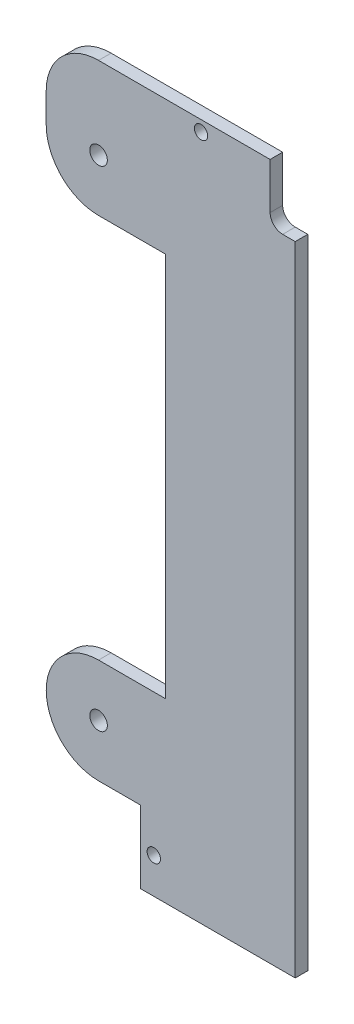
ISO-10303-21;
HEADER;
FILE_DESCRIPTION(('STEP AP214'),'2;1');
FILE_NAME('part.step','',(''),(''),'','','');
FILE_SCHEMA(('AUTOMOTIVE_DESIGN { 1 0 10303 214 1 1 1 1 }'));
ENDSEC;
DATA;
#1=APPLICATION_CONTEXT('core data for automotive mechanical design processes');
#2=APPLICATION_PROTOCOL_DEFINITION('international standard','automotive_design',2000,#1);
#3=PRODUCT_CONTEXT('',#1,'mechanical');
#4=PRODUCT('Part','Part','',(#3));
#5=PRODUCT_RELATED_PRODUCT_CATEGORY('part','',(#4));
#6=PRODUCT_DEFINITION_FORMATION('','',#4);
#7=PRODUCT_DEFINITION_CONTEXT('part definition',#1,'design');
#8=PRODUCT_DEFINITION('design','',#6,#7);
#9=PRODUCT_DEFINITION_SHAPE('','',#8);
#10=(LENGTH_UNIT() NAMED_UNIT(*) SI_UNIT(.MILLI.,.METRE.));
#11=(NAMED_UNIT(*) PLANE_ANGLE_UNIT() SI_UNIT($,.RADIAN.));
#12=(NAMED_UNIT(*) SI_UNIT($,.STERADIAN.) SOLID_ANGLE_UNIT());
#13=UNCERTAINTY_MEASURE_WITH_UNIT(LENGTH_MEASURE(1.E-05),#10,'distance_accuracy_value','');
#14=(GEOMETRIC_REPRESENTATION_CONTEXT(3) GLOBAL_UNCERTAINTY_ASSIGNED_CONTEXT((#13)) GLOBAL_UNIT_ASSIGNED_CONTEXT((#10,
#11,#12)) REPRESENTATION_CONTEXT('',''));
#15=CARTESIAN_POINT('',(0.,0.,0.));
#16=DIRECTION('',(0.,0.,1.));
#17=DIRECTION('',(1.,0.,0.));
#18=AXIS2_PLACEMENT_3D('',#15,#16,#17);
#19=CARTESIAN_POINT('',(0.,0.,3.));
#20=DIRECTION('',(0.,0.,1.));
#21=DIRECTION('',(1.,0.,0.));
#22=AXIS2_PLACEMENT_3D('',#19,#20,#21);
#23=PLANE('',#22);
#24=CARTESIAN_POINT('',(13.2,-21.3,3.));
#25=DIRECTION('',(0.,0.,1.));
#26=DIRECTION('',(1.,0.,0.));
#27=AXIS2_PLACEMENT_3D('',#24,#25,#26);
#28=CIRCLE('',#27,1.6);
#29=CARTESIAN_POINT('',(14.8,-21.3,3.));
#30=VERTEX_POINT('',#29);
#31=EDGE_CURVE('E340',#30,#30,#28,.T.);
#32=ORIENTED_EDGE('',*,*,#31,.F.);
#33=EDGE_LOOP('',(#32));
#34=FACE_BOUND('',#33,.T.);
#35=CARTESIAN_POINT('',(0.,0.,3.));
#36=DIRECTION('',(0.,0.,1.));
#37=DIRECTION('',(1.,0.,0.));
#38=AXIS2_PLACEMENT_3D('',#35,#36,#37);
#39=CIRCLE('',#38,2.1);
#40=CARTESIAN_POINT('',(2.1,0.,3.));
#41=VERTEX_POINT('',#40);
#42=EDGE_CURVE('E185',#41,#41,#39,.T.);
#43=ORIENTED_EDGE('',*,*,#42,.F.);
#44=EDGE_LOOP('',(#43));
#45=FACE_BOUND('',#44,.T.);
#46=DIRECTION('',(0.,1.,0.));
#47=VECTOR('',#46,1.);
#48=CARTESIAN_POINT('',(47.,122.6,3.));
#49=LINE('',#48,#47);
#50=CARTESIAN_POINT('',(47.,-29.8,3.));
#51=VERTEX_POINT('',#50);
#52=CARTESIAN_POINT('',(47.,122.6,3.));
#53=VERTEX_POINT('',#52);
#54=EDGE_CURVE('E210',#51,#53,#49,.T.);
#55=ORIENTED_EDGE('',*,*,#54,.T.);
#56=DIRECTION('',(-1.,0.,0.));
#57=VECTOR('',#56,1.);
#58=CARTESIAN_POINT('',(44.,122.6,3.));
#59=LINE('',#58,#57);
#60=CARTESIAN_POINT('',(44.,122.6,3.));
#61=VERTEX_POINT('',#60);
#62=EDGE_CURVE('E122',#53,#61,#59,.T.);
#63=ORIENTED_EDGE('',*,*,#62,.T.);
#64=CARTESIAN_POINT('',(44.,125.6,3.));
#65=DIRECTION('',(0.,0.,-1.));
#66=DIRECTION('',(1.,0.,0.));
#67=AXIS2_PLACEMENT_3D('',#64,#65,#66);
#68=CIRCLE('',#67,2.99999999999999);
#69=CARTESIAN_POINT('',(41.,125.6,3.));
#70=VERTEX_POINT('',#69);
#71=EDGE_CURVE('E246',#61,#70,#68,.T.);
#72=ORIENTED_EDGE('',*,*,#71,.T.);
#73=DIRECTION('',(0.,1.,0.));
#74=VECTOR('',#73,1.);
#75=CARTESIAN_POINT('',(41.,136.6,3.));
#76=LINE('',#75,#74);
#77=CARTESIAN_POINT('',(41.,136.6,3.));
#78=VERTEX_POINT('',#77);
#79=EDGE_CURVE('E265',#70,#78,#76,.T.);
#80=ORIENTED_EDGE('',*,*,#79,.T.);
#81=DIRECTION('',(-1.,0.,0.));
#82=VECTOR('',#81,1.);
#83=CARTESIAN_POINT('',(0.,136.6,3.));
#84=LINE('',#83,#82);
#85=CARTESIAN_POINT('',(0.,136.6,3.));
#86=VERTEX_POINT('',#85);
#87=EDGE_CURVE('E262',#78,#86,#84,.T.);
#88=ORIENTED_EDGE('',*,*,#87,.T.);
#89=CARTESIAN_POINT('',(0.,124.1,3.));
#90=DIRECTION('',(0.,0.,1.));
#91=DIRECTION('',(1.,0.,0.));
#92=AXIS2_PLACEMENT_3D('',#89,#90,#91);
#93=CIRCLE('',#92,12.5);
#94=CARTESIAN_POINT('',(-12.5,124.1,3.));
#95=VERTEX_POINT('',#94);
#96=EDGE_CURVE('E264',#86,#95,#93,.T.);
#97=ORIENTED_EDGE('',*,*,#96,.T.);
#98=DIRECTION('',(0.,-1.,0.));
#99=VECTOR('',#98,1.);
#100=CARTESIAN_POINT('',(-12.5,124.1,3.));
#101=LINE('',#100,#99);
#102=CARTESIAN_POINT('',(-12.5,117.,3.));
#103=VERTEX_POINT('',#102);
#104=EDGE_CURVE('E267',#95,#103,#101,.T.);
#105=ORIENTED_EDGE('',*,*,#104,.T.);
#106=CARTESIAN_POINT('',(0.,117.,3.));
#107=DIRECTION('',(0.,0.,1.));
#108=DIRECTION('',(1.,0.,0.));
#109=AXIS2_PLACEMENT_3D('',#106,#107,#108);
#110=CIRCLE('',#109,12.5);
#111=CARTESIAN_POINT('',(0.,104.5,3.));
#112=VERTEX_POINT('',#111);
#113=EDGE_CURVE('E273',#103,#112,#110,.T.);
#114=ORIENTED_EDGE('',*,*,#113,.T.);
#115=DIRECTION('',(1.,0.,0.));
#116=VECTOR('',#115,1.);
#117=CARTESIAN_POINT('',(0.,104.5,3.));
#118=LINE('',#117,#116);
#119=CARTESIAN_POINT('',(16.,104.5,3.));
#120=VERTEX_POINT('',#119);
#121=EDGE_CURVE('E275',#112,#120,#118,.T.);
#122=ORIENTED_EDGE('',*,*,#121,.T.);
#123=DIRECTION('',(0.,-1.,0.));
#124=VECTOR('',#123,1.);
#125=CARTESIAN_POINT('',(16.,104.5,3.));
#126=LINE('',#125,#124);
#127=CARTESIAN_POINT('',(16.,12.5,3.));
#128=VERTEX_POINT('',#127);
#129=EDGE_CURVE('E277',#120,#128,#126,.T.);
#130=ORIENTED_EDGE('',*,*,#129,.T.);
#131=DIRECTION('',(-1.,0.,0.));
#132=VECTOR('',#131,1.);
#133=CARTESIAN_POINT('',(0.,12.5,3.));
#134=LINE('',#133,#132);
#135=CARTESIAN_POINT('',(0.,12.5,3.));
#136=VERTEX_POINT('',#135);
#137=EDGE_CURVE('E279',#128,#136,#134,.T.);
#138=ORIENTED_EDGE('',*,*,#137,.T.);
#139=CARTESIAN_POINT('',(0.,0.,3.));
#140=DIRECTION('',(0.,0.,1.));
#141=DIRECTION('',(1.,0.,0.));
#142=AXIS2_PLACEMENT_3D('',#139,#140,#141);
#143=CIRCLE('',#142,12.5);
#144=CARTESIAN_POINT('',(1.30930550206618E-13,-12.5,3.));
#145=VERTEX_POINT('',#144);
#146=EDGE_CURVE('E162',#136,#145,#143,.T.);
#147=ORIENTED_EDGE('',*,*,#146,.T.);
#148=DIRECTION('',(1.,0.,0.));
#149=VECTOR('',#148,1.);
#150=CARTESIAN_POINT('',(1.30930550206618E-13,-12.5,3.));
#151=LINE('',#150,#149);
#152=CARTESIAN_POINT('',(10.,-12.5,3.));
#153=VERTEX_POINT('',#152);
#154=EDGE_CURVE('E156',#145,#153,#151,.T.);
#155=ORIENTED_EDGE('',*,*,#154,.T.);
#156=DIRECTION('',(0.,-1.,0.));
#157=VECTOR('',#156,1.);
#158=CARTESIAN_POINT('',(10.,-29.8,3.));
#159=LINE('',#158,#157);
#160=CARTESIAN_POINT('',(10.,-29.8,3.));
#161=VERTEX_POINT('',#160);
#162=EDGE_CURVE('E160',#153,#161,#159,.T.);
#163=ORIENTED_EDGE('',*,*,#162,.T.);
#164=DIRECTION('',(1.,0.,0.));
#165=VECTOR('',#164,1.);
#166=CARTESIAN_POINT('',(10.,-29.8,3.));
#167=LINE('',#166,#165);
#168=EDGE_CURVE('E58',#161,#51,#167,.T.);
#169=ORIENTED_EDGE('',*,*,#168,.T.);
#170=EDGE_LOOP('',(#55,#63,#72,#80,#88,#97,#105,#114,#122,#130,#138,#147,#155,#163,#169));
#171=FACE_BOUND('',#170,.T.);
#172=CARTESIAN_POINT('',(0.,117.,3.));
#173=DIRECTION('',(0.,0.,1.));
#174=DIRECTION('',(1.,0.,0.));
#175=AXIS2_PLACEMENT_3D('',#172,#173,#174);
#176=CIRCLE('',#175,2.1);
#177=CARTESIAN_POINT('',(2.1,117.,3.));
#178=VERTEX_POINT('',#177);
#179=EDGE_CURVE('E346',#178,#178,#176,.T.);
#180=ORIENTED_EDGE('',*,*,#179,.F.);
#181=EDGE_LOOP('',(#180));
#182=FACE_BOUND('',#181,.T.);
#183=CARTESIAN_POINT('',(24.5,134.,3.));
#184=DIRECTION('',(0.,0.,1.));
#185=DIRECTION('',(1.,0.,0.));
#186=AXIS2_PLACEMENT_3D('',#183,#184,#185);
#187=CIRCLE('',#186,1.59999999999999);
#188=CARTESIAN_POINT('',(26.1,134.,3.));
#189=VERTEX_POINT('',#188);
#190=EDGE_CURVE('E331',#189,#189,#187,.T.);
#191=ORIENTED_EDGE('',*,*,#190,.F.);
#192=EDGE_LOOP('',(#191));
#193=FACE_BOUND('',#192,.T.);
#194=ADVANCED_FACE('F41',(#34,#45,#171,#182,#193),#23,.T.);
#195=CARTESIAN_POINT('',(0.,0.,0.));
#196=DIRECTION('',(0.,0.,1.));
#197=DIRECTION('',(1.,0.,0.));
#198=AXIS2_PLACEMENT_3D('',#195,#196,#197);
#199=PLANE('',#198);
#200=CARTESIAN_POINT('',(13.2,-21.3,0.));
#201=DIRECTION('',(0.,0.,1.));
#202=DIRECTION('',(1.,0.,0.));
#203=AXIS2_PLACEMENT_3D('',#200,#201,#202);
#204=CIRCLE('',#203,1.6);
#205=CARTESIAN_POINT('',(14.8,-21.3,0.));
#206=VERTEX_POINT('',#205);
#207=EDGE_CURVE('E337',#206,#206,#204,.T.);
#208=ORIENTED_EDGE('',*,*,#207,.T.);
#209=EDGE_LOOP('',(#208));
#210=FACE_BOUND('',#209,.T.);
#211=CARTESIAN_POINT('',(0.,0.,0.));
#212=DIRECTION('',(0.,0.,1.));
#213=DIRECTION('',(1.,0.,0.));
#214=AXIS2_PLACEMENT_3D('',#211,#212,#213);
#215=CIRCLE('',#214,2.1);
#216=CARTESIAN_POINT('',(2.1,0.,0.));
#217=VERTEX_POINT('',#216);
#218=EDGE_CURVE('E349',#217,#217,#215,.T.);
#219=ORIENTED_EDGE('',*,*,#218,.T.);
#220=EDGE_LOOP('',(#219));
#221=FACE_BOUND('',#220,.T.);
#222=DIRECTION('',(0.,1.,0.));
#223=VECTOR('',#222,1.);
#224=CARTESIAN_POINT('',(47.,122.6,0.));
#225=LINE('',#224,#223);
#226=CARTESIAN_POINT('',(47.,-29.8,0.));
#227=VERTEX_POINT('',#226);
#228=CARTESIAN_POINT('',(47.,122.6,0.));
#229=VERTEX_POINT('',#228);
#230=EDGE_CURVE('E180',#227,#229,#225,.T.);
#231=ORIENTED_EDGE('',*,*,#230,.F.);
#232=DIRECTION('',(1.,0.,0.));
#233=VECTOR('',#232,1.);
#234=CARTESIAN_POINT('',(10.,-29.8,0.));
#235=LINE('',#234,#233);
#236=CARTESIAN_POINT('',(10.,-29.8,0.));
#237=VERTEX_POINT('',#236);
#238=EDGE_CURVE('E114',#237,#227,#235,.T.);
#239=ORIENTED_EDGE('',*,*,#238,.F.);
#240=DIRECTION('',(0.,-1.,0.));
#241=VECTOR('',#240,1.);
#242=CARTESIAN_POINT('',(10.,-29.8,0.));
#243=LINE('',#242,#241);
#244=CARTESIAN_POINT('',(10.,-12.5,0.));
#245=VERTEX_POINT('',#244);
#246=EDGE_CURVE('E108',#245,#237,#243,.T.);
#247=ORIENTED_EDGE('',*,*,#246,.F.);
#248=DIRECTION('',(1.,0.,0.));
#249=VECTOR('',#248,1.);
#250=CARTESIAN_POINT('',(1.30930550206618E-13,-12.5,0.));
#251=LINE('',#250,#249);
#252=CARTESIAN_POINT('',(1.30930550206618E-13,-12.5,0.));
#253=VERTEX_POINT('',#252);
#254=EDGE_CURVE('E170',#253,#245,#251,.T.);
#255=ORIENTED_EDGE('',*,*,#254,.F.);
#256=CARTESIAN_POINT('',(0.,0.,0.));
#257=DIRECTION('',(0.,0.,1.));
#258=DIRECTION('',(1.,0.,0.));
#259=AXIS2_PLACEMENT_3D('',#256,#257,#258);
#260=CIRCLE('',#259,12.5);
#261=CARTESIAN_POINT('',(0.,12.5,0.));
#262=VERTEX_POINT('',#261);
#263=EDGE_CURVE('E205',#262,#253,#260,.T.);
#264=ORIENTED_EDGE('',*,*,#263,.F.);
#265=DIRECTION('',(-1.,0.,0.));
#266=VECTOR('',#265,1.);
#267=CARTESIAN_POINT('',(0.,12.5,0.));
#268=LINE('',#267,#266);
#269=CARTESIAN_POINT('',(16.,12.5,0.));
#270=VERTEX_POINT('',#269);
#271=EDGE_CURVE('E203',#270,#262,#268,.T.);
#272=ORIENTED_EDGE('',*,*,#271,.F.);
#273=DIRECTION('',(0.,-1.,0.));
#274=VECTOR('',#273,1.);
#275=CARTESIAN_POINT('',(16.,104.5,0.));
#276=LINE('',#275,#274);
#277=CARTESIAN_POINT('',(16.,104.5,0.));
#278=VERTEX_POINT('',#277);
#279=EDGE_CURVE('E201',#278,#270,#276,.T.);
#280=ORIENTED_EDGE('',*,*,#279,.F.);
#281=DIRECTION('',(1.,0.,0.));
#282=VECTOR('',#281,1.);
#283=CARTESIAN_POINT('',(0.,104.5,0.));
#284=LINE('',#283,#282);
#285=CARTESIAN_POINT('',(0.,104.5,0.));
#286=VERTEX_POINT('',#285);
#287=EDGE_CURVE('E199',#286,#278,#284,.T.);
#288=ORIENTED_EDGE('',*,*,#287,.F.);
#289=CARTESIAN_POINT('',(0.,117.,0.));
#290=DIRECTION('',(0.,0.,1.));
#291=DIRECTION('',(1.,0.,0.));
#292=AXIS2_PLACEMENT_3D('',#289,#290,#291);
#293=CIRCLE('',#292,12.5);
#294=CARTESIAN_POINT('',(-12.5,117.,0.));
#295=VERTEX_POINT('',#294);
#296=EDGE_CURVE('E197',#295,#286,#293,.T.);
#297=ORIENTED_EDGE('',*,*,#296,.F.);
#298=DIRECTION('',(0.,-1.,0.));
#299=VECTOR('',#298,1.);
#300=CARTESIAN_POINT('',(-12.5,124.1,0.));
#301=LINE('',#300,#299);
#302=CARTESIAN_POINT('',(-12.5,124.1,0.));
#303=VERTEX_POINT('',#302);
#304=EDGE_CURVE('E195',#303,#295,#301,.T.);
#305=ORIENTED_EDGE('',*,*,#304,.F.);
#306=CARTESIAN_POINT('',(0.,124.1,0.));
#307=DIRECTION('',(0.,0.,1.));
#308=DIRECTION('',(1.,0.,0.));
#309=AXIS2_PLACEMENT_3D('',#306,#307,#308);
#310=CIRCLE('',#309,12.5);
#311=CARTESIAN_POINT('',(0.,136.6,0.));
#312=VERTEX_POINT('',#311);
#313=EDGE_CURVE('E193',#312,#303,#310,.T.);
#314=ORIENTED_EDGE('',*,*,#313,.F.);
#315=DIRECTION('',(-1.,0.,0.));
#316=VECTOR('',#315,1.);
#317=CARTESIAN_POINT('',(0.,136.6,0.));
#318=LINE('',#317,#316);
#319=CARTESIAN_POINT('',(41.,136.6,0.));
#320=VERTEX_POINT('',#319);
#321=EDGE_CURVE('E191',#320,#312,#318,.T.);
#322=ORIENTED_EDGE('',*,*,#321,.F.);
#323=DIRECTION('',(0.,1.,0.));
#324=VECTOR('',#323,1.);
#325=CARTESIAN_POINT('',(41.,136.6,0.));
#326=LINE('',#325,#324);
#327=CARTESIAN_POINT('',(41.,125.6,0.));
#328=VERTEX_POINT('',#327);
#329=EDGE_CURVE('E189',#328,#320,#326,.T.);
#330=ORIENTED_EDGE('',*,*,#329,.F.);
#331=CARTESIAN_POINT('',(44.,125.6,0.));
#332=DIRECTION('',(0.,0.,-1.));
#333=DIRECTION('',(1.,0.,0.));
#334=AXIS2_PLACEMENT_3D('',#331,#332,#333);
#335=CIRCLE('',#334,2.99999999999999);
#336=CARTESIAN_POINT('',(44.,122.6,0.));
#337=VERTEX_POINT('',#336);
#338=EDGE_CURVE('E187',#337,#328,#335,.T.);
#339=ORIENTED_EDGE('',*,*,#338,.F.);
#340=DIRECTION('',(-1.,0.,0.));
#341=VECTOR('',#340,1.);
#342=CARTESIAN_POINT('',(44.,122.6,0.));
#343=LINE('',#342,#341);
#344=EDGE_CURVE('E184',#229,#337,#343,.T.);
#345=ORIENTED_EDGE('',*,*,#344,.F.);
#346=EDGE_LOOP('',(#231,#239,#247,#255,#264,#272,#280,#288,#297,#305,#314,#322,#330,#339,#345));
#347=FACE_BOUND('',#346,.T.);
#348=CARTESIAN_POINT('',(0.,117.,0.));
#349=DIRECTION('',(0.,0.,1.));
#350=DIRECTION('',(1.,0.,0.));
#351=AXIS2_PLACEMENT_3D('',#348,#349,#350);
#352=CIRCLE('',#351,2.1);
#353=CARTESIAN_POINT('',(2.1,117.,0.));
#354=VERTEX_POINT('',#353);
#355=EDGE_CURVE('E343',#354,#354,#352,.T.);
#356=ORIENTED_EDGE('',*,*,#355,.T.);
#357=EDGE_LOOP('',(#356));
#358=FACE_BOUND('',#357,.T.);
#359=CARTESIAN_POINT('',(24.5,134.,0.));
#360=DIRECTION('',(0.,0.,1.));
#361=DIRECTION('',(1.,0.,0.));
#362=AXIS2_PLACEMENT_3D('',#359,#360,#361);
#363=CIRCLE('',#362,1.59999999999999);
#364=CARTESIAN_POINT('',(26.1,134.,0.));
#365=VERTEX_POINT('',#364);
#366=EDGE_CURVE('E334',#365,#365,#363,.T.);
#367=ORIENTED_EDGE('',*,*,#366,.T.);
#368=EDGE_LOOP('',(#367));
#369=FACE_BOUND('',#368,.T.);
#370=ADVANCED_FACE('F250',(#210,#221,#347,#358,#369),#199,.F.);
#371=CARTESIAN_POINT('',(47.,122.6,3.));
#372=DIRECTION('',(-1.,0.,0.));
#373=DIRECTION('',(0.,-1.,0.));
#374=AXIS2_PLACEMENT_3D('',#371,#372,#373);
#375=PLANE('',#374);
#376=ORIENTED_EDGE('',*,*,#230,.T.);
#377=DIRECTION('',(0.,0.,-1.));
#378=VECTOR('',#377,1.);
#379=CARTESIAN_POINT('',(47.,122.6,3.));
#380=LINE('',#379,#378);
#381=EDGE_CURVE('E11',#53,#229,#380,.T.);
#382=ORIENTED_EDGE('',*,*,#381,.F.);
#383=ORIENTED_EDGE('',*,*,#54,.F.);
#384=DIRECTION('',(0.,0.,-1.));
#385=VECTOR('',#384,1.);
#386=CARTESIAN_POINT('',(47.,-29.8,3.));
#387=LINE('',#386,#385);
#388=EDGE_CURVE('E176',#51,#227,#387,.T.);
#389=ORIENTED_EDGE('',*,*,#388,.T.);
#390=EDGE_LOOP('',(#376,#382,#383,#389));
#391=FACE_BOUND('',#390,.T.);
#392=ADVANCED_FACE('F43',(#391),#375,.F.);
#393=CARTESIAN_POINT('',(44.,122.6,3.));
#394=DIRECTION('',(0.,-1.,0.));
#395=DIRECTION('',(1.,0.,0.));
#396=AXIS2_PLACEMENT_3D('',#393,#394,#395);
#397=PLANE('',#396);
#398=ORIENTED_EDGE('',*,*,#344,.T.);
#399=DIRECTION('',(0.,0.,-1.));
#400=VECTOR('',#399,1.);
#401=CARTESIAN_POINT('',(44.,122.6,3.));
#402=LINE('',#401,#400);
#403=EDGE_CURVE('E50',#61,#337,#402,.T.);
#404=ORIENTED_EDGE('',*,*,#403,.F.);
#405=ORIENTED_EDGE('',*,*,#62,.F.);
#406=ORIENTED_EDGE('',*,*,#381,.T.);
#407=EDGE_LOOP('',(#398,#404,#405,#406));
#408=FACE_BOUND('',#407,.T.);
#409=ADVANCED_FACE('F489',(#408),#397,.F.);
#410=CARTESIAN_POINT('',(44.,125.6,3.));
#411=DIRECTION('',(0.,0.,-1.));
#412=DIRECTION('',(-1.,0.,0.));
#413=AXIS2_PLACEMENT_3D('',#410,#411,#412);
#414=CYLINDRICAL_SURFACE('',#413,2.99999999999999);
#415=ORIENTED_EDGE('',*,*,#338,.T.);
#416=DIRECTION('',(0.,0.,-1.));
#417=VECTOR('',#416,1.);
#418=CARTESIAN_POINT('',(41.,125.6,3.));
#419=LINE('',#418,#417);
#420=EDGE_CURVE('E238',#70,#328,#419,.T.);
#421=ORIENTED_EDGE('',*,*,#420,.F.);
#422=ORIENTED_EDGE('',*,*,#71,.F.);
#423=ORIENTED_EDGE('',*,*,#403,.T.);
#424=EDGE_LOOP('',(#415,#421,#422,#423));
#425=FACE_BOUND('',#424,.T.);
#426=ADVANCED_FACE('F244',(#425),#414,.F.);
#427=CARTESIAN_POINT('',(41.,136.6,3.));
#428=DIRECTION('',(-1.,0.,0.));
#429=DIRECTION('',(0.,0.,1.));
#430=AXIS2_PLACEMENT_3D('',#427,#428,#429);
#431=PLANE('',#430);
#432=ORIENTED_EDGE('',*,*,#329,.T.);
#433=DIRECTION('',(0.,0.,-1.));
#434=VECTOR('',#433,1.);
#435=CARTESIAN_POINT('',(41.,136.6,3.));
#436=LINE('',#435,#434);
#437=EDGE_CURVE('E235',#78,#320,#436,.T.);
#438=ORIENTED_EDGE('',*,*,#437,.F.);
#439=ORIENTED_EDGE('',*,*,#79,.F.);
#440=ORIENTED_EDGE('',*,*,#420,.T.);
#441=EDGE_LOOP('',(#432,#438,#439,#440));
#442=FACE_BOUND('',#441,.T.);
#443=ADVANCED_FACE('F256',(#442),#431,.F.);
#444=CARTESIAN_POINT('',(0.,136.6,3.));
#445=DIRECTION('',(0.,-1.,0.));
#446=DIRECTION('',(0.,0.,-1.));
#447=AXIS2_PLACEMENT_3D('',#444,#445,#446);
#448=PLANE('',#447);
#449=ORIENTED_EDGE('',*,*,#321,.T.);
#450=DIRECTION('',(0.,0.,-1.));
#451=VECTOR('',#450,1.);
#452=CARTESIAN_POINT('',(0.,136.6,3.));
#453=LINE('',#452,#451);
#454=EDGE_CURVE('E232',#86,#312,#453,.T.);
#455=ORIENTED_EDGE('',*,*,#454,.F.);
#456=ORIENTED_EDGE('',*,*,#87,.F.);
#457=ORIENTED_EDGE('',*,*,#437,.T.);
#458=EDGE_LOOP('',(#449,#455,#456,#457));
#459=FACE_BOUND('',#458,.T.);
#460=ADVANCED_FACE('F260',(#459),#448,.F.);
#461=CARTESIAN_POINT('',(0.,124.1,3.));
#462=DIRECTION('',(0.,0.,-1.));
#463=DIRECTION('',(-1.,0.,0.));
#464=AXIS2_PLACEMENT_3D('',#461,#462,#463);
#465=CYLINDRICAL_SURFACE('',#464,12.5);
#466=ORIENTED_EDGE('',*,*,#313,.T.);
#467=DIRECTION('',(0.,0.,-1.));
#468=VECTOR('',#467,1.);
#469=CARTESIAN_POINT('',(-12.5,124.1,3.));
#470=LINE('',#469,#468);
#471=EDGE_CURVE('E229',#95,#303,#470,.T.);
#472=ORIENTED_EDGE('',*,*,#471,.F.);
#473=ORIENTED_EDGE('',*,*,#96,.F.);
#474=ORIENTED_EDGE('',*,*,#454,.T.);
#475=EDGE_LOOP('',(#466,#472,#473,#474));
#476=FACE_BOUND('',#475,.T.);
#477=ADVANCED_FACE('F454',(#476),#465,.T.);
#478=CARTESIAN_POINT('',(-12.5,124.1,3.));
#479=DIRECTION('',(1.,0.,0.));
#480=DIRECTION('',(0.,1.,0.));
#481=AXIS2_PLACEMENT_3D('',#478,#479,#480);
#482=PLANE('',#481);
#483=ORIENTED_EDGE('',*,*,#304,.T.);
#484=DIRECTION('',(0.,0.,-1.));
#485=VECTOR('',#484,1.);
#486=CARTESIAN_POINT('',(-12.5,117.,3.));
#487=LINE('',#486,#485);
#488=EDGE_CURVE('E226',#103,#295,#487,.T.);
#489=ORIENTED_EDGE('',*,*,#488,.F.);
#490=ORIENTED_EDGE('',*,*,#104,.F.);
#491=ORIENTED_EDGE('',*,*,#471,.T.);
#492=EDGE_LOOP('',(#483,#489,#490,#491));
#493=FACE_BOUND('',#492,.T.);
#494=ADVANCED_FACE('F444',(#493),#482,.F.);
#495=CARTESIAN_POINT('',(0.,117.,3.));
#496=DIRECTION('',(0.,0.,-1.));
#497=DIRECTION('',(-1.,0.,0.));
#498=AXIS2_PLACEMENT_3D('',#495,#496,#497);
#499=CYLINDRICAL_SURFACE('',#498,12.5);
#500=ORIENTED_EDGE('',*,*,#296,.T.);
#501=DIRECTION('',(0.,0.,-1.));
#502=VECTOR('',#501,1.);
#503=CARTESIAN_POINT('',(0.,104.5,3.));
#504=LINE('',#503,#502);
#505=EDGE_CURVE('E223',#112,#286,#504,.T.);
#506=ORIENTED_EDGE('',*,*,#505,.F.);
#507=ORIENTED_EDGE('',*,*,#113,.F.);
#508=ORIENTED_EDGE('',*,*,#488,.T.);
#509=EDGE_LOOP('',(#500,#506,#507,#508));
#510=FACE_BOUND('',#509,.T.);
#511=ADVANCED_FACE('F434',(#510),#499,.T.);
#512=CARTESIAN_POINT('',(0.,104.5,3.));
#513=DIRECTION('',(0.,1.,0.));
#514=DIRECTION('',(0.,0.,1.));
#515=AXIS2_PLACEMENT_3D('',#512,#513,#514);
#516=PLANE('',#515);
#517=ORIENTED_EDGE('',*,*,#287,.T.);
#518=DIRECTION('',(0.,0.,-1.));
#519=VECTOR('',#518,1.);
#520=CARTESIAN_POINT('',(16.,104.5,3.));
#521=LINE('',#520,#519);
#522=EDGE_CURVE('E220',#120,#278,#521,.T.);
#523=ORIENTED_EDGE('',*,*,#522,.F.);
#524=ORIENTED_EDGE('',*,*,#121,.F.);
#525=ORIENTED_EDGE('',*,*,#505,.T.);
#526=EDGE_LOOP('',(#517,#523,#524,#525));
#527=FACE_BOUND('',#526,.T.);
#528=ADVANCED_FACE('F424',(#527),#516,.F.);
#529=CARTESIAN_POINT('',(16.,104.5,3.));
#530=DIRECTION('',(1.,0.,0.));
#531=DIRECTION('',(0.,1.,0.));
#532=AXIS2_PLACEMENT_3D('',#529,#530,#531);
#533=PLANE('',#532);
#534=ORIENTED_EDGE('',*,*,#279,.T.);
#535=DIRECTION('',(0.,0.,-1.));
#536=VECTOR('',#535,1.);
#537=CARTESIAN_POINT('',(16.,12.5,3.));
#538=LINE('',#537,#536);
#539=EDGE_CURVE('E217',#128,#270,#538,.T.);
#540=ORIENTED_EDGE('',*,*,#539,.F.);
#541=ORIENTED_EDGE('',*,*,#129,.F.);
#542=ORIENTED_EDGE('',*,*,#522,.T.);
#543=EDGE_LOOP('',(#534,#540,#541,#542));
#544=FACE_BOUND('',#543,.T.);
#545=ADVANCED_FACE('F415',(#544),#533,.F.);
#546=CARTESIAN_POINT('',(0.,12.5,3.));
#547=DIRECTION('',(0.,-1.,0.));
#548=DIRECTION('',(0.,0.,-1.));
#549=AXIS2_PLACEMENT_3D('',#546,#547,#548);
#550=PLANE('',#549);
#551=ORIENTED_EDGE('',*,*,#271,.T.);
#552=DIRECTION('',(0.,0.,-1.));
#553=VECTOR('',#552,1.);
#554=CARTESIAN_POINT('',(0.,12.5,3.));
#555=LINE('',#554,#553);
#556=EDGE_CURVE('E214',#136,#262,#555,.T.);
#557=ORIENTED_EDGE('',*,*,#556,.F.);
#558=ORIENTED_EDGE('',*,*,#137,.F.);
#559=ORIENTED_EDGE('',*,*,#539,.T.);
#560=EDGE_LOOP('',(#551,#557,#558,#559));
#561=FACE_BOUND('',#560,.T.);
#562=ADVANCED_FACE('F285',(#561),#550,.F.);
#563=CARTESIAN_POINT('',(0.,0.,3.));
#564=DIRECTION('',(0.,0.,-1.));
#565=DIRECTION('',(-1.,0.,0.));
#566=AXIS2_PLACEMENT_3D('',#563,#564,#565);
#567=CYLINDRICAL_SURFACE('',#566,12.5);
#568=ORIENTED_EDGE('',*,*,#263,.T.);
#569=DIRECTION('',(0.,0.,-1.));
#570=VECTOR('',#569,1.);
#571=CARTESIAN_POINT('',(1.30930550206618E-13,-12.5,3.));
#572=LINE('',#571,#570);
#573=EDGE_CURVE('E171',#145,#253,#572,.T.);
#574=ORIENTED_EDGE('',*,*,#573,.F.);
#575=ORIENTED_EDGE('',*,*,#146,.F.);
#576=ORIENTED_EDGE('',*,*,#556,.T.);
#577=EDGE_LOOP('',(#568,#574,#575,#576));
#578=FACE_BOUND('',#577,.T.);
#579=ADVANCED_FACE('F289',(#578),#567,.T.);
#580=CARTESIAN_POINT('',(1.30930550206618E-13,-12.5,3.));
#581=DIRECTION('',(0.,1.,0.));
#582=DIRECTION('',(0.,0.,1.));
#583=AXIS2_PLACEMENT_3D('',#580,#581,#582);
#584=PLANE('',#583);
#585=ORIENTED_EDGE('',*,*,#254,.T.);
#586=DIRECTION('',(0.,0.,-1.));
#587=VECTOR('',#586,1.);
#588=CARTESIAN_POINT('',(10.,-12.5,3.));
#589=LINE('',#588,#587);
#590=EDGE_CURVE('E167',#153,#245,#589,.T.);
#591=ORIENTED_EDGE('',*,*,#590,.F.);
#592=ORIENTED_EDGE('',*,*,#154,.F.);
#593=ORIENTED_EDGE('',*,*,#573,.T.);
#594=EDGE_LOOP('',(#585,#591,#592,#593));
#595=FACE_BOUND('',#594,.T.);
#596=ADVANCED_FACE('F168',(#595),#584,.F.);
#597=CARTESIAN_POINT('',(10.,-29.8,3.));
#598=DIRECTION('',(1.,0.,0.));
#599=DIRECTION('',(0.,1.,0.));
#600=AXIS2_PLACEMENT_3D('',#597,#598,#599);
#601=PLANE('',#600);
#602=ORIENTED_EDGE('',*,*,#246,.T.);
#603=DIRECTION('',(0.,0.,-1.));
#604=VECTOR('',#603,1.);
#605=CARTESIAN_POINT('',(10.,-29.8,3.));
#606=LINE('',#605,#604);
#607=EDGE_CURVE('E172',#161,#237,#606,.T.);
#608=ORIENTED_EDGE('',*,*,#607,.F.);
#609=ORIENTED_EDGE('',*,*,#162,.F.);
#610=ORIENTED_EDGE('',*,*,#590,.T.);
#611=EDGE_LOOP('',(#602,#608,#609,#610));
#612=FACE_BOUND('',#611,.T.);
#613=ADVANCED_FACE('F174',(#612),#601,.F.);
#614=CARTESIAN_POINT('',(10.,-29.8,3.));
#615=DIRECTION('',(0.,1.,0.));
#616=DIRECTION('',(0.,0.,1.));
#617=AXIS2_PLACEMENT_3D('',#614,#615,#616);
#618=PLANE('',#617);
#619=ORIENTED_EDGE('',*,*,#238,.T.);
#620=ORIENTED_EDGE('',*,*,#388,.F.);
#621=ORIENTED_EDGE('',*,*,#168,.F.);
#622=ORIENTED_EDGE('',*,*,#607,.T.);
#623=EDGE_LOOP('',(#619,#620,#621,#622));
#624=FACE_BOUND('',#623,.T.);
#625=ADVANCED_FACE('F293',(#624),#618,.F.);
#626=CARTESIAN_POINT('',(0.,0.,3.));
#627=DIRECTION('',(0.,0.,-1.));
#628=DIRECTION('',(-1.,0.,0.));
#629=AXIS2_PLACEMENT_3D('',#626,#627,#628);
#630=CYLINDRICAL_SURFACE('',#629,2.1);
#631=ORIENTED_EDGE('',*,*,#42,.T.);
#632=EDGE_LOOP('',(#631));
#633=FACE_BOUND('',#632,.T.);
#634=ORIENTED_EDGE('',*,*,#218,.F.);
#635=EDGE_LOOP('',(#634));
#636=FACE_BOUND('',#635,.T.);
#637=ADVANCED_FACE('F295',(#633,#636),#630,.F.);
#638=CARTESIAN_POINT('',(0.,117.,3.));
#639=DIRECTION('',(0.,0.,-1.));
#640=DIRECTION('',(-1.,0.,0.));
#641=AXIS2_PLACEMENT_3D('',#638,#639,#640);
#642=CYLINDRICAL_SURFACE('',#641,2.1);
#643=ORIENTED_EDGE('',*,*,#179,.T.);
#644=EDGE_LOOP('',(#643));
#645=FACE_BOUND('',#644,.T.);
#646=ORIENTED_EDGE('',*,*,#355,.F.);
#647=EDGE_LOOP('',(#646));
#648=FACE_BOUND('',#647,.T.);
#649=ADVANCED_FACE('F301',(#645,#648),#642,.F.);
#650=CARTESIAN_POINT('',(13.2,-21.3,3.));
#651=DIRECTION('',(0.,0.,-1.));
#652=DIRECTION('',(-1.,0.,0.));
#653=AXIS2_PLACEMENT_3D('',#650,#651,#652);
#654=CYLINDRICAL_SURFACE('',#653,1.6);
#655=ORIENTED_EDGE('',*,*,#31,.T.);
#656=EDGE_LOOP('',(#655));
#657=FACE_BOUND('',#656,.T.);
#658=ORIENTED_EDGE('',*,*,#207,.F.);
#659=EDGE_LOOP('',(#658));
#660=FACE_BOUND('',#659,.T.);
#661=ADVANCED_FACE('F318',(#657,#660),#654,.F.);
#662=CARTESIAN_POINT('',(24.5,134.,3.));
#663=DIRECTION('',(0.,0.,-1.));
#664=DIRECTION('',(-1.,0.,0.));
#665=AXIS2_PLACEMENT_3D('',#662,#663,#664);
#666=CYLINDRICAL_SURFACE('',#665,1.59999999999999);
#667=ORIENTED_EDGE('',*,*,#190,.T.);
#668=EDGE_LOOP('',(#667));
#669=FACE_BOUND('',#668,.T.);
#670=ORIENTED_EDGE('',*,*,#366,.F.);
#671=EDGE_LOOP('',(#670));
#672=FACE_BOUND('',#671,.T.);
#673=ADVANCED_FACE('F322',(#669,#672),#666,.F.);
#674=CLOSED_SHELL('',(#194,#370,#392,#409,#426,#443,#460,#477,#494,#511,#528,#545,#562,#579,
#596,#613,#625,#637,#649,#661,#673));
#675=MANIFOLD_SOLID_BREP('B2',#674);
#676=ADVANCED_BREP_SHAPE_REPRESENTATION('',(#18,#675),#14);
#677=SHAPE_DEFINITION_REPRESENTATION(#9,#676);
ENDSEC;
END-ISO-10303-21;
